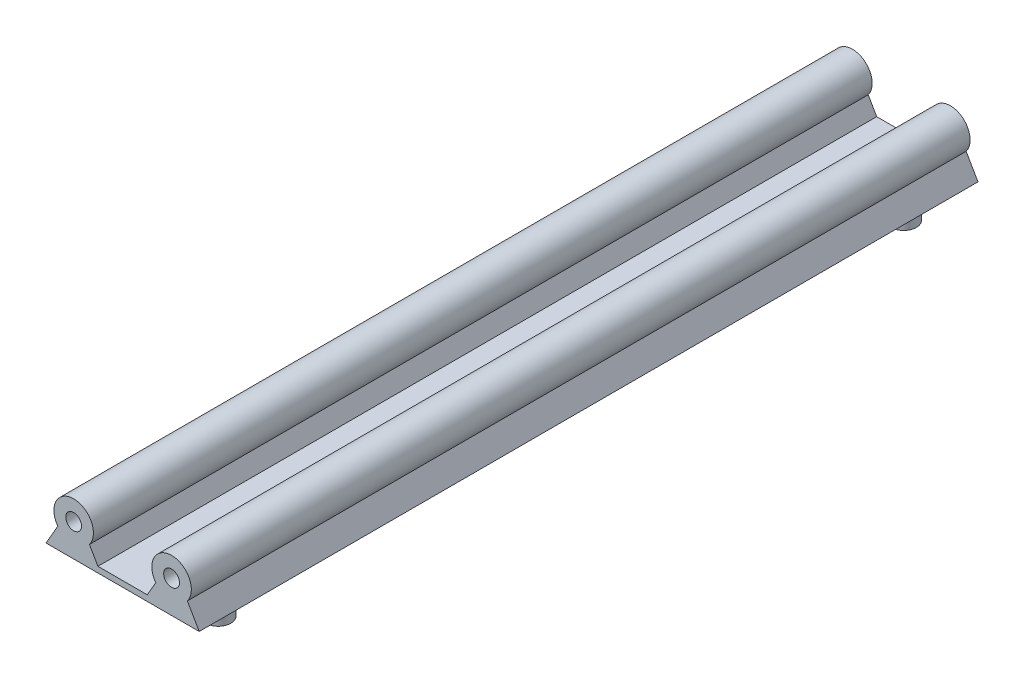
ISO-10303-21;
HEADER;
FILE_DESCRIPTION(('STEP AP214'),'2;1');
FILE_NAME('part.step','',(''),(''),'','','');
FILE_SCHEMA(('AUTOMOTIVE_DESIGN { 1 0 10303 214 1 1 1 1 }'));
ENDSEC;
DATA;
#1=APPLICATION_CONTEXT('core data for automotive mechanical design processes');
#2=APPLICATION_PROTOCOL_DEFINITION('international standard','automotive_design',2000,#1);
#3=PRODUCT_CONTEXT('',#1,'mechanical');
#4=PRODUCT('Part','Part','',(#3));
#5=PRODUCT_RELATED_PRODUCT_CATEGORY('part','',(#4));
#6=PRODUCT_DEFINITION_FORMATION('','',#4);
#7=PRODUCT_DEFINITION_CONTEXT('part definition',#1,'design');
#8=PRODUCT_DEFINITION('design','',#6,#7);
#9=PRODUCT_DEFINITION_SHAPE('','',#8);
#10=(LENGTH_UNIT() NAMED_UNIT(*) SI_UNIT(.MILLI.,.METRE.));
#11=(NAMED_UNIT(*) PLANE_ANGLE_UNIT() SI_UNIT($,.RADIAN.));
#12=(NAMED_UNIT(*) SI_UNIT($,.STERADIAN.) SOLID_ANGLE_UNIT());
#13=UNCERTAINTY_MEASURE_WITH_UNIT(LENGTH_MEASURE(1.E-05),#10,'distance_accuracy_value','');
#14=(GEOMETRIC_REPRESENTATION_CONTEXT(3) GLOBAL_UNCERTAINTY_ASSIGNED_CONTEXT((#13)) GLOBAL_UNIT_ASSIGNED_CONTEXT((#10,
#11,#12)) REPRESENTATION_CONTEXT('',''));
#15=CARTESIAN_POINT('',(0.,0.,0.));
#16=DIRECTION('',(0.,0.,1.));
#17=DIRECTION('',(1.,0.,0.));
#18=AXIS2_PLACEMENT_3D('',#15,#16,#17);
#19=CARTESIAN_POINT('',(0.,0.,220.));
#20=DIRECTION('',(0.,0.,-1.));
#21=DIRECTION('',(-1.,0.,0.));
#22=AXIS2_PLACEMENT_3D('',#19,#20,#21);
#23=CYLINDRICAL_SURFACE('',#22,5.);
#24=CARTESIAN_POINT('',(0.,0.,208.6));
#25=DIRECTION('',(0.,0.,1.));
#26=DIRECTION('',(1.,0.,0.));
#27=AXIS2_PLACEMENT_3D('',#24,#25,#26);
#28=CIRCLE('',#27,5.);
#29=CARTESIAN_POINT('',(4.,-3.,208.6));
#30=VERTEX_POINT('',#29);
#31=CARTESIAN_POINT('',(-4.,-3.,208.6));
#32=VERTEX_POINT('',#31);
#33=EDGE_CURVE('E256',#30,#32,#28,.T.);
#34=ORIENTED_EDGE('',*,*,#33,.F.);
#35=DIRECTION('',(0.,0.,-1.));
#36=VECTOR('',#35,1.);
#37=CARTESIAN_POINT('',(4.,-3.,220.));
#38=LINE('',#37,#36);
#39=CARTESIAN_POINT('',(4.,-3.,11.4));
#40=VERTEX_POINT('',#39);
#41=EDGE_CURVE('E169',#30,#40,#38,.T.);
#42=ORIENTED_EDGE('',*,*,#41,.T.);
#43=CARTESIAN_POINT('',(0.,0.,11.4));
#44=DIRECTION('',(0.,0.,-1.));
#45=DIRECTION('',(-1.,0.,0.));
#46=AXIS2_PLACEMENT_3D('',#43,#44,#45);
#47=CIRCLE('',#46,5.);
#48=CARTESIAN_POINT('',(-4.,-3.,11.4));
#49=VERTEX_POINT('',#48);
#50=EDGE_CURVE('E233',#49,#40,#47,.T.);
#51=ORIENTED_EDGE('',*,*,#50,.F.);
#52=DIRECTION('',(0.,0.,-1.));
#53=VECTOR('',#52,1.);
#54=CARTESIAN_POINT('',(-4.,-3.,220.));
#55=LINE('',#54,#53);
#56=EDGE_CURVE('E175',#32,#49,#55,.T.);
#57=ORIENTED_EDGE('',*,*,#56,.F.);
#58=EDGE_LOOP('',(#34,#42,#51,#57));
#59=FACE_BOUND('',#58,.T.);
#60=ADVANCED_FACE('F48',(#59),#23,.T.);
#61=CARTESIAN_POINT('',(-1.70096189432334,0.982050807568877,220.));
#62=DIRECTION('',(0.866025403784438,-0.5,0.));
#63=DIRECTION('',(0.5,0.866025403784439,0.));
#64=AXIS2_PLACEMENT_3D('',#61,#62,#63);
#65=PLANE('',#64);
#66=DIRECTION('',(-0.5,-0.866025403784439,0.));
#67=VECTOR('',#66,1.);
#68=CARTESIAN_POINT('',(-4.,-3.,208.6));
#69=LINE('',#68,#67);
#70=CARTESIAN_POINT('',(-7.,-8.19615242270663,208.6));
#71=VERTEX_POINT('',#70);
#72=EDGE_CURVE('E197',#32,#71,#69,.T.);
#73=ORIENTED_EDGE('',*,*,#72,.F.);
#74=ORIENTED_EDGE('',*,*,#56,.T.);
#75=DIRECTION('',(0.5,0.866025403784439,0.));
#76=VECTOR('',#75,1.);
#77=CARTESIAN_POINT('',(-4.,-3.,11.4));
#78=LINE('',#77,#76);
#79=CARTESIAN_POINT('',(-7.,-8.19615242270663,11.4));
#80=VERTEX_POINT('',#79);
#81=EDGE_CURVE('E204',#80,#49,#78,.T.);
#82=ORIENTED_EDGE('',*,*,#81,.F.);
#83=DIRECTION('',(0.,0.,-1.));
#84=VECTOR('',#83,1.);
#85=CARTESIAN_POINT('',(-7.,-8.19615242270663,220.));
#86=LINE('',#85,#84);
#87=EDGE_CURVE('E172',#71,#80,#86,.T.);
#88=ORIENTED_EDGE('',*,*,#87,.F.);
#89=EDGE_LOOP('',(#73,#74,#82,#88));
#90=FACE_BOUND('',#89,.T.);
#91=ADVANCED_FACE('F187',(#90),#65,.F.);
#92=CARTESIAN_POINT('',(0.,-8.19615242270663,220.));
#93=DIRECTION('',(0.,1.,0.));
#94=DIRECTION('',(0.,0.,1.));
#95=AXIS2_PLACEMENT_3D('',#92,#93,#94);
#96=PLANE('',#95);
#97=CARTESIAN_POINT('',(24.8000000000018,-8.19615242270663,23.2000000000003));
#98=DIRECTION('',(0.,1.,0.));
#99=DIRECTION('',(0.,0.,1.));
#100=AXIS2_PLACEMENT_3D('',#97,#98,#99);
#101=CIRCLE('',#100,3.2);
#102=CARTESIAN_POINT('',(24.8000000000018,-8.19615242270663,26.4000000000003));
#103=VERTEX_POINT('',#102);
#104=EDGE_CURVE('E151',#103,#103,#101,.F.);
#105=ORIENTED_EDGE('',*,*,#104,.F.);
#106=EDGE_LOOP('',(#105));
#107=FACE_BOUND('',#106,.T.);
#108=CARTESIAN_POINT('',(24.8,-8.19615242270663,196.8));
#109=DIRECTION('',(0.,1.,0.));
#110=DIRECTION('',(0.,0.,1.));
#111=AXIS2_PLACEMENT_3D('',#108,#109,#110);
#112=CIRCLE('',#111,3.2);
#113=CARTESIAN_POINT('',(24.8,-8.19615242270663,200.));
#114=VERTEX_POINT('',#113);
#115=EDGE_CURVE('E147',#114,#114,#112,.F.);
#116=ORIENTED_EDGE('',*,*,#115,.F.);
#117=EDGE_LOOP('',(#116));
#118=FACE_BOUND('',#117,.T.);
#119=CARTESIAN_POINT('',(0.,-8.19615242270663,196.8));
#120=DIRECTION('',(0.,1.,0.));
#121=DIRECTION('',(0.,0.,1.));
#122=AXIS2_PLACEMENT_3D('',#119,#120,#121);
#123=CIRCLE('',#122,3.20000000000001);
#124=CARTESIAN_POINT('',(0.,-8.19615242270663,200.));
#125=VERTEX_POINT('',#124);
#126=EDGE_CURVE('E56',#125,#125,#123,.F.);
#127=ORIENTED_EDGE('',*,*,#126,.F.);
#128=EDGE_LOOP('',(#127));
#129=FACE_BOUND('',#128,.T.);
#130=CARTESIAN_POINT('',(1.8077335470529E-12,-8.19615242270663,23.2));
#131=DIRECTION('',(0.,1.,0.));
#132=DIRECTION('',(0.,0.,1.));
#133=AXIS2_PLACEMENT_3D('',#130,#131,#132);
#134=CIRCLE('',#133,3.2);
#135=CARTESIAN_POINT('',(1.8077335470529E-12,-8.19615242270663,26.4));
#136=VERTEX_POINT('',#135);
#137=EDGE_CURVE('E11',#136,#136,#134,.F.);
#138=ORIENTED_EDGE('',*,*,#137,.F.);
#139=EDGE_LOOP('',(#138));
#140=FACE_BOUND('',#139,.T.);
#141=DIRECTION('',(1.,0.,0.));
#142=VECTOR('',#141,1.);
#143=CARTESIAN_POINT('',(-7.,-8.19615242270663,208.6));
#144=LINE('',#143,#142);
#145=CARTESIAN_POINT('',(31.8,-8.19615242270663,208.6));
#146=VERTEX_POINT('',#145);
#147=EDGE_CURVE('E63',#71,#146,#144,.T.);
#148=ORIENTED_EDGE('',*,*,#147,.F.);
#149=ORIENTED_EDGE('',*,*,#87,.T.);
#150=DIRECTION('',(-1.,0.,0.));
#151=VECTOR('',#150,1.);
#152=CARTESIAN_POINT('',(-7.,-8.19615242270663,11.4));
#153=LINE('',#152,#151);
#154=CARTESIAN_POINT('',(31.8,-8.19615242270663,11.4));
#155=VERTEX_POINT('',#154);
#156=EDGE_CURVE('E209',#155,#80,#153,.T.);
#157=ORIENTED_EDGE('',*,*,#156,.F.);
#158=DIRECTION('',(0.,0.,-1.));
#159=VECTOR('',#158,1.);
#160=CARTESIAN_POINT('',(31.8,-8.19615242270663,220.));
#161=LINE('',#160,#159);
#162=EDGE_CURVE('E136',#146,#155,#161,.T.);
#163=ORIENTED_EDGE('',*,*,#162,.F.);
#164=EDGE_LOOP('',(#148,#149,#157,#163));
#165=FACE_BOUND('',#164,.T.);
#166=ADVANCED_FACE('F183',(#107,#118,#129,#140,#165),#96,.F.);
#167=CARTESIAN_POINT('',(1.70096189432334,0.982050807568877,220.));
#168=DIRECTION('',(0.866025403784438,0.5,0.));
#169=DIRECTION('',(-0.5,0.866025403784439,0.));
#170=AXIS2_PLACEMENT_3D('',#167,#168,#169);
#171=PLANE('',#170);
#172=ORIENTED_EDGE('',*,*,#41,.F.);
#173=DIRECTION('',(-0.5,0.866025403784439,0.));
#174=VECTOR('',#173,1.);
#175=CARTESIAN_POINT('',(6.15,-6.72390923627308,208.6));
#176=LINE('',#175,#174);
#177=CARTESIAN_POINT('',(6.15,-6.72390923627308,208.6));
#178=VERTEX_POINT('',#177);
#179=EDGE_CURVE('E259',#178,#30,#176,.T.);
#180=ORIENTED_EDGE('',*,*,#179,.F.);
#181=DIRECTION('',(0.,0.,1.));
#182=VECTOR('',#181,1.);
#183=CARTESIAN_POINT('',(6.15,-6.72390923627308,0.));
#184=LINE('',#183,#182);
#185=CARTESIAN_POINT('',(6.15,-6.72390923627308,11.4));
#186=VERTEX_POINT('',#185);
#187=EDGE_CURVE('E155',#186,#178,#184,.T.);
#188=ORIENTED_EDGE('',*,*,#187,.F.);
#189=DIRECTION('',(0.5,-0.866025403784439,0.));
#190=VECTOR('',#189,1.);
#191=CARTESIAN_POINT('',(4.,-3.,11.4));
#192=LINE('',#191,#190);
#193=EDGE_CURVE('E230',#40,#186,#192,.T.);
#194=ORIENTED_EDGE('',*,*,#193,.F.);
#195=EDGE_LOOP('',(#172,#180,#188,#194));
#196=FACE_BOUND('',#195,.T.);
#197=ADVANCED_FACE('F186',(#196),#171,.T.);
#198=CARTESIAN_POINT('',(6.15,-6.72390923627308,0.));
#199=DIRECTION('',(0.,1.,0.));
#200=DIRECTION('',(-1.,0.,0.));
#201=AXIS2_PLACEMENT_3D('',#198,#199,#200);
#202=PLANE('',#201);
#203=ORIENTED_EDGE('',*,*,#187,.T.);
#204=DIRECTION('',(-1.,0.,0.));
#205=VECTOR('',#204,1.);
#206=CARTESIAN_POINT('',(18.65,-6.72390923627309,208.6));
#207=LINE('',#206,#205);
#208=CARTESIAN_POINT('',(18.65,-6.72390923627309,208.6));
#209=VERTEX_POINT('',#208);
#210=EDGE_CURVE('E131',#209,#178,#207,.T.);
#211=ORIENTED_EDGE('',*,*,#210,.F.);
#212=DIRECTION('',(0.,0.,1.));
#213=VECTOR('',#212,1.);
#214=CARTESIAN_POINT('',(18.65,-6.72390923627309,0.));
#215=LINE('',#214,#213);
#216=CARTESIAN_POINT('',(18.65,-6.72390923627309,11.4));
#217=VERTEX_POINT('',#216);
#218=EDGE_CURVE('E129',#217,#209,#215,.T.);
#219=ORIENTED_EDGE('',*,*,#218,.F.);
#220=DIRECTION('',(1.,0.,0.));
#221=VECTOR('',#220,1.);
#222=CARTESIAN_POINT('',(18.65,-6.72390923627309,11.4));
#223=LINE('',#222,#221);
#224=EDGE_CURVE('E227',#186,#217,#223,.T.);
#225=ORIENTED_EDGE('',*,*,#224,.F.);
#226=EDGE_LOOP('',(#203,#211,#219,#225));
#227=FACE_BOUND('',#226,.T.);
#228=ADVANCED_FACE('F320',(#227),#202,.T.);
#229=CARTESIAN_POINT('',(24.8,0.,220.));
#230=DIRECTION('',(0.,0.,-1.));
#231=DIRECTION('',(-1.,0.,0.));
#232=AXIS2_PLACEMENT_3D('',#229,#230,#231);
#233=CYLINDRICAL_SURFACE('',#232,5.);
#234=DIRECTION('',(0.,0.,-1.));
#235=VECTOR('',#234,1.);
#236=CARTESIAN_POINT('',(20.8,-3.,220.));
#237=LINE('',#236,#235);
#238=CARTESIAN_POINT('',(20.8,-3.,208.6));
#239=VERTEX_POINT('',#238);
#240=CARTESIAN_POINT('',(20.8,-3.,11.4));
#241=VERTEX_POINT('',#240);
#242=EDGE_CURVE('E126',#239,#241,#237,.T.);
#243=ORIENTED_EDGE('',*,*,#242,.F.);
#244=CARTESIAN_POINT('',(24.8,0.,208.6));
#245=DIRECTION('',(0.,0.,1.));
#246=DIRECTION('',(1.,0.,0.));
#247=AXIS2_PLACEMENT_3D('',#244,#245,#246);
#248=CIRCLE('',#247,5.);
#249=CARTESIAN_POINT('',(28.8,-3.,208.6));
#250=VERTEX_POINT('',#249);
#251=EDGE_CURVE('E112',#250,#239,#248,.T.);
#252=ORIENTED_EDGE('',*,*,#251,.F.);
#253=DIRECTION('',(0.,0.,-1.));
#254=VECTOR('',#253,1.);
#255=CARTESIAN_POINT('',(28.8,-3.,220.));
#256=LINE('',#255,#254);
#257=CARTESIAN_POINT('',(28.8,-3.,11.4));
#258=VERTEX_POINT('',#257);
#259=EDGE_CURVE('E71',#250,#258,#256,.T.);
#260=ORIENTED_EDGE('',*,*,#259,.T.);
#261=CARTESIAN_POINT('',(24.8,0.,11.4));
#262=DIRECTION('',(0.,0.,-1.));
#263=DIRECTION('',(-1.,0.,0.));
#264=AXIS2_PLACEMENT_3D('',#261,#262,#263);
#265=CIRCLE('',#264,5.);
#266=EDGE_CURVE('E134',#241,#258,#265,.T.);
#267=ORIENTED_EDGE('',*,*,#266,.F.);
#268=EDGE_LOOP('',(#243,#252,#260,#267));
#269=FACE_BOUND('',#268,.T.);
#270=ADVANCED_FACE('F133',(#269),#233,.T.);
#271=CARTESIAN_POINT('',(20.8,-3.,220.));
#272=DIRECTION('',(0.866025403784439,-0.5,0.));
#273=DIRECTION('',(0.5,0.866025403784439,0.));
#274=AXIS2_PLACEMENT_3D('',#271,#272,#273);
#275=PLANE('',#274);
#276=DIRECTION('',(-0.5,-0.866025403784439,0.));
#277=VECTOR('',#276,1.);
#278=CARTESIAN_POINT('',(20.8,-3.,208.6));
#279=LINE('',#278,#277);
#280=EDGE_CURVE('E115',#239,#209,#279,.T.);
#281=ORIENTED_EDGE('',*,*,#280,.F.);
#282=ORIENTED_EDGE('',*,*,#242,.T.);
#283=DIRECTION('',(0.5,0.866025403784439,0.));
#284=VECTOR('',#283,1.);
#285=CARTESIAN_POINT('',(20.8,-3.,11.4));
#286=LINE('',#285,#284);
#287=EDGE_CURVE('E224',#217,#241,#286,.T.);
#288=ORIENTED_EDGE('',*,*,#287,.F.);
#289=ORIENTED_EDGE('',*,*,#218,.T.);
#290=EDGE_LOOP('',(#281,#282,#288,#289));
#291=FACE_BOUND('',#290,.T.);
#292=ADVANCED_FACE('F124',(#291),#275,.F.);
#293=CARTESIAN_POINT('',(28.8,-3.,220.));
#294=DIRECTION('',(0.866025403784438,0.5,0.));
#295=DIRECTION('',(-0.5,0.866025403784438,0.));
#296=AXIS2_PLACEMENT_3D('',#293,#294,#295);
#297=PLANE('',#296);
#298=ORIENTED_EDGE('',*,*,#259,.F.);
#299=DIRECTION('',(-0.5,0.866025403784438,0.));
#300=VECTOR('',#299,1.);
#301=CARTESIAN_POINT('',(31.8,-8.19615242270663,208.6));
#302=LINE('',#301,#300);
#303=EDGE_CURVE('E117',#146,#250,#302,.T.);
#304=ORIENTED_EDGE('',*,*,#303,.F.);
#305=ORIENTED_EDGE('',*,*,#162,.T.);
#306=DIRECTION('',(0.5,-0.866025403784438,0.));
#307=VECTOR('',#306,1.);
#308=CARTESIAN_POINT('',(28.8,-3.,11.4));
#309=LINE('',#308,#307);
#310=EDGE_CURVE('E215',#258,#155,#309,.T.);
#311=ORIENTED_EDGE('',*,*,#310,.F.);
#312=EDGE_LOOP('',(#298,#304,#305,#311));
#313=FACE_BOUND('',#312,.T.);
#314=ADVANCED_FACE('F346',(#313),#297,.T.);
#315=CARTESIAN_POINT('',(0.,-14.1961524227066,196.8));
#316=DIRECTION('',(0.,1.,0.));
#317=DIRECTION('',(0.,0.,1.));
#318=AXIS2_PLACEMENT_3D('',#315,#316,#317);
#319=CYLINDRICAL_SURFACE('',#318,3.20000000000001);
#320=CARTESIAN_POINT('',(0.,-14.1961524227066,196.8));
#321=DIRECTION('',(0.,-1.,0.));
#322=DIRECTION('',(0.,0.,-1.));
#323=AXIS2_PLACEMENT_3D('',#320,#321,#322);
#324=CIRCLE('',#323,3.20000000000001);
#325=CARTESIAN_POINT('',(0.,-14.1961524227066,193.6));
#326=VERTEX_POINT('',#325);
#327=EDGE_CURVE('E165',#326,#326,#324,.T.);
#328=ORIENTED_EDGE('',*,*,#327,.F.);
#329=EDGE_LOOP('',(#328));
#330=FACE_BOUND('',#329,.T.);
#331=ORIENTED_EDGE('',*,*,#126,.T.);
#332=EDGE_LOOP('',(#331));
#333=FACE_BOUND('',#332,.T.);
#334=ADVANCED_FACE('F181',(#330,#333),#319,.T.);
#335=CARTESIAN_POINT('',(0.,-14.1961524227066,196.8));
#336=DIRECTION('',(0.,-1.,0.));
#337=DIRECTION('',(0.,0.,-1.));
#338=AXIS2_PLACEMENT_3D('',#335,#336,#337);
#339=PLANE('',#338);
#340=ORIENTED_EDGE('',*,*,#327,.T.);
#341=EDGE_LOOP('',(#340));
#342=FACE_BOUND('',#341,.T.);
#343=ADVANCED_FACE('F336',(#342),#339,.T.);
#344=CARTESIAN_POINT('',(1.8077335470529E-12,-14.1961524227066,23.2));
#345=DIRECTION('',(0.,1.,0.));
#346=DIRECTION('',(0.,0.,1.));
#347=AXIS2_PLACEMENT_3D('',#344,#345,#346);
#348=CYLINDRICAL_SURFACE('',#347,3.2);
#349=CARTESIAN_POINT('',(1.8077335470529E-12,-14.1961524227066,23.2));
#350=DIRECTION('',(0.,-1.,0.));
#351=DIRECTION('',(0.,0.,-1.));
#352=AXIS2_PLACEMENT_3D('',#349,#350,#351);
#353=CIRCLE('',#352,3.2);
#354=CARTESIAN_POINT('',(1.8077335470529E-12,-14.1961524227066,20.));
#355=VERTEX_POINT('',#354);
#356=EDGE_CURVE('E159',#355,#355,#353,.T.);
#357=ORIENTED_EDGE('',*,*,#356,.F.);
#358=EDGE_LOOP('',(#357));
#359=FACE_BOUND('',#358,.T.);
#360=ORIENTED_EDGE('',*,*,#137,.T.);
#361=EDGE_LOOP('',(#360));
#362=FACE_BOUND('',#361,.T.);
#363=ADVANCED_FACE('F332',(#359,#362),#348,.T.);
#364=CARTESIAN_POINT('',(1.8077335470529E-12,-14.1961524227066,23.2));
#365=DIRECTION('',(0.,-1.,0.));
#366=DIRECTION('',(0.,0.,-1.));
#367=AXIS2_PLACEMENT_3D('',#364,#365,#366);
#368=PLANE('',#367);
#369=ORIENTED_EDGE('',*,*,#356,.T.);
#370=EDGE_LOOP('',(#369));
#371=FACE_BOUND('',#370,.T.);
#372=ADVANCED_FACE('F335',(#371),#368,.T.);
#373=CARTESIAN_POINT('',(24.8,-14.1961524227066,196.8));
#374=DIRECTION('',(0.,1.,0.));
#375=DIRECTION('',(0.,0.,1.));
#376=AXIS2_PLACEMENT_3D('',#373,#374,#375);
#377=CYLINDRICAL_SURFACE('',#376,3.2);
#378=CARTESIAN_POINT('',(24.8,-14.1961524227066,196.8));
#379=DIRECTION('',(0.,-1.,0.));
#380=DIRECTION('',(0.,0.,-1.));
#381=AXIS2_PLACEMENT_3D('',#378,#379,#380);
#382=CIRCLE('',#381,3.2);
#383=CARTESIAN_POINT('',(24.8,-14.1961524227066,193.6));
#384=VERTEX_POINT('',#383);
#385=EDGE_CURVE('E137',#384,#384,#382,.T.);
#386=ORIENTED_EDGE('',*,*,#385,.F.);
#387=EDGE_LOOP('',(#386));
#388=FACE_BOUND('',#387,.T.);
#389=ORIENTED_EDGE('',*,*,#115,.T.);
#390=EDGE_LOOP('',(#389));
#391=FACE_BOUND('',#390,.T.);
#392=ADVANCED_FACE('F340',(#388,#391),#377,.T.);
#393=CARTESIAN_POINT('',(24.8,-14.1961524227066,196.8));
#394=DIRECTION('',(0.,-1.,0.));
#395=DIRECTION('',(0.,0.,-1.));
#396=AXIS2_PLACEMENT_3D('',#393,#394,#395);
#397=PLANE('',#396);
#398=ORIENTED_EDGE('',*,*,#385,.T.);
#399=EDGE_LOOP('',(#398));
#400=FACE_BOUND('',#399,.T.);
#401=ADVANCED_FACE('F357',(#400),#397,.T.);
#402=CARTESIAN_POINT('',(24.8000000000018,-14.1961524227066,23.2000000000003));
#403=DIRECTION('',(0.,1.,0.));
#404=DIRECTION('',(0.,0.,1.));
#405=AXIS2_PLACEMENT_3D('',#402,#403,#404);
#406=CYLINDRICAL_SURFACE('',#405,3.2);
#407=CARTESIAN_POINT('',(24.8000000000018,-14.1961524227066,23.2000000000003));
#408=DIRECTION('',(0.,-1.,0.));
#409=DIRECTION('',(0.,0.,-1.));
#410=AXIS2_PLACEMENT_3D('',#407,#408,#409);
#411=CIRCLE('',#410,3.2);
#412=CARTESIAN_POINT('',(24.8000000000018,-14.1961524227066,20.0000000000003));
#413=VERTEX_POINT('',#412);
#414=EDGE_CURVE('E143',#413,#413,#411,.T.);
#415=ORIENTED_EDGE('',*,*,#414,.F.);
#416=EDGE_LOOP('',(#415));
#417=FACE_BOUND('',#416,.T.);
#418=ORIENTED_EDGE('',*,*,#104,.T.);
#419=EDGE_LOOP('',(#418));
#420=FACE_BOUND('',#419,.T.);
#421=ADVANCED_FACE('F360',(#417,#420),#406,.T.);
#422=CARTESIAN_POINT('',(24.8000000000018,-14.1961524227066,23.2000000000003));
#423=DIRECTION('',(0.,-1.,0.));
#424=DIRECTION('',(0.,0.,-1.));
#425=AXIS2_PLACEMENT_3D('',#422,#423,#424);
#426=PLANE('',#425);
#427=ORIENTED_EDGE('',*,*,#414,.T.);
#428=EDGE_LOOP('',(#427));
#429=FACE_BOUND('',#428,.T.);
#430=ADVANCED_FACE('F365',(#429),#426,.T.);
#431=CARTESIAN_POINT('',(0.,0.,11.4));
#432=DIRECTION('',(0.,0.,-1.));
#433=DIRECTION('',(-1.,0.,0.));
#434=AXIS2_PLACEMENT_3D('',#431,#432,#433);
#435=PLANE('',#434);
#436=CARTESIAN_POINT('',(24.8,0.,11.4));
#437=DIRECTION('',(0.,0.,-1.));
#438=DIRECTION('',(-1.,0.,0.));
#439=AXIS2_PLACEMENT_3D('',#436,#437,#438);
#440=CIRCLE('',#439,2.);
#441=CARTESIAN_POINT('',(22.8,0.,11.4));
#442=VERTEX_POINT('',#441);
#443=EDGE_CURVE('E245',#442,#442,#440,.T.);
#444=ORIENTED_EDGE('',*,*,#443,.F.);
#445=EDGE_LOOP('',(#444));
#446=FACE_BOUND('',#445,.T.);
#447=CARTESIAN_POINT('',(0.,0.,11.4));
#448=DIRECTION('',(0.,0.,-1.));
#449=DIRECTION('',(-1.,0.,0.));
#450=AXIS2_PLACEMENT_3D('',#447,#448,#449);
#451=CIRCLE('',#450,2.);
#452=CARTESIAN_POINT('',(-2.,0.,11.4));
#453=VERTEX_POINT('',#452);
#454=EDGE_CURVE('E241',#453,#453,#451,.T.);
#455=ORIENTED_EDGE('',*,*,#454,.F.);
#456=EDGE_LOOP('',(#455));
#457=FACE_BOUND('',#456,.T.);
#458=ORIENTED_EDGE('',*,*,#50,.T.);
#459=ORIENTED_EDGE('',*,*,#193,.T.);
#460=ORIENTED_EDGE('',*,*,#224,.T.);
#461=ORIENTED_EDGE('',*,*,#287,.T.);
#462=ORIENTED_EDGE('',*,*,#266,.T.);
#463=ORIENTED_EDGE('',*,*,#310,.T.);
#464=ORIENTED_EDGE('',*,*,#156,.T.);
#465=ORIENTED_EDGE('',*,*,#81,.T.);
#466=EDGE_LOOP('',(#458,#459,#460,#461,#462,#463,#464,#465));
#467=FACE_BOUND('',#466,.T.);
#468=ADVANCED_FACE('F318',(#446,#457,#467),#435,.T.);
#469=CARTESIAN_POINT('',(0.,0.,18.4));
#470=DIRECTION('',(0.,0.,-1.));
#471=DIRECTION('',(-1.,0.,0.));
#472=AXIS2_PLACEMENT_3D('',#469,#470,#471);
#473=CYLINDRICAL_SURFACE('',#472,2.);
#474=CARTESIAN_POINT('',(0.,0.,18.4));
#475=DIRECTION('',(0.,0.,-1.));
#476=DIRECTION('',(-1.,0.,0.));
#477=AXIS2_PLACEMENT_3D('',#474,#475,#476);
#478=CIRCLE('',#477,2.);
#479=CARTESIAN_POINT('',(-2.,0.,18.4));
#480=VERTEX_POINT('',#479);
#481=EDGE_CURVE('E237',#480,#480,#478,.T.);
#482=ORIENTED_EDGE('',*,*,#481,.F.);
#483=EDGE_LOOP('',(#482));
#484=FACE_BOUND('',#483,.T.);
#485=ORIENTED_EDGE('',*,*,#454,.T.);
#486=EDGE_LOOP('',(#485));
#487=FACE_BOUND('',#486,.T.);
#488=ADVANCED_FACE('F374',(#484,#487),#473,.F.);
#489=CARTESIAN_POINT('',(0.,0.,18.4));
#490=DIRECTION('',(0.,0.,-1.));
#491=DIRECTION('',(-1.,0.,0.));
#492=AXIS2_PLACEMENT_3D('',#489,#490,#491);
#493=PLANE('',#492);
#494=ORIENTED_EDGE('',*,*,#481,.T.);
#495=EDGE_LOOP('',(#494));
#496=FACE_BOUND('',#495,.T.);
#497=ADVANCED_FACE('F376',(#496),#493,.T.);
#498=CARTESIAN_POINT('',(24.8,0.,18.4));
#499=DIRECTION('',(0.,0.,-1.));
#500=DIRECTION('',(-1.,0.,0.));
#501=AXIS2_PLACEMENT_3D('',#498,#499,#500);
#502=CYLINDRICAL_SURFACE('',#501,2.);
#503=CARTESIAN_POINT('',(24.8,0.,18.4));
#504=DIRECTION('',(0.,0.,-1.));
#505=DIRECTION('',(-1.,0.,0.));
#506=AXIS2_PLACEMENT_3D('',#503,#504,#505);
#507=CIRCLE('',#506,2.);
#508=CARTESIAN_POINT('',(22.8,0.,18.4));
#509=VERTEX_POINT('',#508);
#510=EDGE_CURVE('E236',#509,#509,#507,.T.);
#511=ORIENTED_EDGE('',*,*,#510,.F.);
#512=EDGE_LOOP('',(#511));
#513=FACE_BOUND('',#512,.T.);
#514=ORIENTED_EDGE('',*,*,#443,.T.);
#515=EDGE_LOOP('',(#514));
#516=FACE_BOUND('',#515,.T.);
#517=ADVANCED_FACE('F379',(#513,#516),#502,.F.);
#518=CARTESIAN_POINT('',(24.8,0.,18.4));
#519=DIRECTION('',(0.,0.,-1.));
#520=DIRECTION('',(-1.,0.,0.));
#521=AXIS2_PLACEMENT_3D('',#518,#519,#520);
#522=PLANE('',#521);
#523=ORIENTED_EDGE('',*,*,#510,.T.);
#524=EDGE_LOOP('',(#523));
#525=FACE_BOUND('',#524,.T.);
#526=ADVANCED_FACE('F292',(#525),#522,.T.);
#527=CARTESIAN_POINT('',(24.8,0.,208.6));
#528=DIRECTION('',(0.,0.,1.));
#529=DIRECTION('',(1.,0.,0.));
#530=AXIS2_PLACEMENT_3D('',#527,#528,#529);
#531=PLANE('',#530);
#532=CARTESIAN_POINT('',(0.,0.,208.6));
#533=DIRECTION('',(0.,0.,1.));
#534=DIRECTION('',(1.,0.,0.));
#535=AXIS2_PLACEMENT_3D('',#532,#533,#534);
#536=CIRCLE('',#535,2.);
#537=CARTESIAN_POINT('',(2.,0.,208.6));
#538=VERTEX_POINT('',#537);
#539=EDGE_CURVE('E272',#538,#538,#536,.T.);
#540=ORIENTED_EDGE('',*,*,#539,.F.);
#541=EDGE_LOOP('',(#540));
#542=FACE_BOUND('',#541,.T.);
#543=CARTESIAN_POINT('',(24.8,0.,208.6));
#544=DIRECTION('',(0.,0.,1.));
#545=DIRECTION('',(1.,0.,0.));
#546=AXIS2_PLACEMENT_3D('',#543,#544,#545);
#547=CIRCLE('',#546,2.);
#548=CARTESIAN_POINT('',(26.8,0.,208.6));
#549=VERTEX_POINT('',#548);
#550=EDGE_CURVE('E268',#549,#549,#547,.T.);
#551=ORIENTED_EDGE('',*,*,#550,.F.);
#552=EDGE_LOOP('',(#551));
#553=FACE_BOUND('',#552,.T.);
#554=ORIENTED_EDGE('',*,*,#251,.T.);
#555=ORIENTED_EDGE('',*,*,#280,.T.);
#556=ORIENTED_EDGE('',*,*,#210,.T.);
#557=ORIENTED_EDGE('',*,*,#179,.T.);
#558=ORIENTED_EDGE('',*,*,#33,.T.);
#559=ORIENTED_EDGE('',*,*,#72,.T.);
#560=ORIENTED_EDGE('',*,*,#147,.T.);
#561=ORIENTED_EDGE('',*,*,#303,.T.);
#562=EDGE_LOOP('',(#554,#555,#556,#557,#558,#559,#560,#561));
#563=FACE_BOUND('',#562,.T.);
#564=ADVANCED_FACE('F114',(#542,#553,#563),#531,.T.);
#565=CARTESIAN_POINT('',(24.8,0.,201.6));
#566=DIRECTION('',(0.,0.,1.));
#567=DIRECTION('',(1.,0.,0.));
#568=AXIS2_PLACEMENT_3D('',#565,#566,#567);
#569=CYLINDRICAL_SURFACE('',#568,2.);
#570=CARTESIAN_POINT('',(24.8,0.,201.6));
#571=DIRECTION('',(0.,0.,1.));
#572=DIRECTION('',(1.,0.,0.));
#573=AXIS2_PLACEMENT_3D('',#570,#571,#572);
#574=CIRCLE('',#573,2.);
#575=CARTESIAN_POINT('',(26.8,0.,201.6));
#576=VERTEX_POINT('',#575);
#577=EDGE_CURVE('E264',#576,#576,#574,.T.);
#578=ORIENTED_EDGE('',*,*,#577,.F.);
#579=EDGE_LOOP('',(#578));
#580=FACE_BOUND('',#579,.T.);
#581=ORIENTED_EDGE('',*,*,#550,.T.);
#582=EDGE_LOOP('',(#581));
#583=FACE_BOUND('',#582,.T.);
#584=ADVANCED_FACE('F291',(#580,#583),#569,.F.);
#585=CARTESIAN_POINT('',(24.8,0.,201.6));
#586=DIRECTION('',(0.,0.,1.));
#587=DIRECTION('',(1.,0.,0.));
#588=AXIS2_PLACEMENT_3D('',#585,#586,#587);
#589=PLANE('',#588);
#590=ORIENTED_EDGE('',*,*,#577,.T.);
#591=EDGE_LOOP('',(#590));
#592=FACE_BOUND('',#591,.T.);
#593=ADVANCED_FACE('F285',(#592),#589,.T.);
#594=CARTESIAN_POINT('',(0.,0.,201.6));
#595=DIRECTION('',(0.,0.,1.));
#596=DIRECTION('',(1.,0.,0.));
#597=AXIS2_PLACEMENT_3D('',#594,#595,#596);
#598=CYLINDRICAL_SURFACE('',#597,2.);
#599=CARTESIAN_POINT('',(0.,0.,201.6));
#600=DIRECTION('',(0.,0.,1.));
#601=DIRECTION('',(1.,0.,0.));
#602=AXIS2_PLACEMENT_3D('',#599,#600,#601);
#603=CIRCLE('',#602,2.);
#604=CARTESIAN_POINT('',(2.,0.,201.6));
#605=VERTEX_POINT('',#604);
#606=EDGE_CURVE('E120',#605,#605,#603,.T.);
#607=ORIENTED_EDGE('',*,*,#606,.F.);
#608=EDGE_LOOP('',(#607));
#609=FACE_BOUND('',#608,.T.);
#610=ORIENTED_EDGE('',*,*,#539,.T.);
#611=EDGE_LOOP('',(#610));
#612=FACE_BOUND('',#611,.T.);
#613=ADVANCED_FACE('F282',(#609,#612),#598,.F.);
#614=CARTESIAN_POINT('',(0.,0.,201.6));
#615=DIRECTION('',(0.,0.,1.));
#616=DIRECTION('',(1.,0.,0.));
#617=AXIS2_PLACEMENT_3D('',#614,#615,#616);
#618=PLANE('',#617);
#619=ORIENTED_EDGE('',*,*,#606,.T.);
#620=EDGE_LOOP('',(#619));
#621=FACE_BOUND('',#620,.T.);
#622=ADVANCED_FACE('F280',(#621),#618,.T.);
#623=CLOSED_SHELL('',(#60,#91,#166,#197,#228,#270,#292,#314,#334,#343,#363,#372,#392,#401,#421,
#430,#468,#488,#497,#517,#526,#564,#584,#593,#613,#622));
#624=MANIFOLD_SOLID_BREP('B2',#623);
#625=ADVANCED_BREP_SHAPE_REPRESENTATION('',(#18,#624),#14);
#626=SHAPE_DEFINITION_REPRESENTATION(#9,#625);
ENDSEC;
END-ISO-10303-21;
